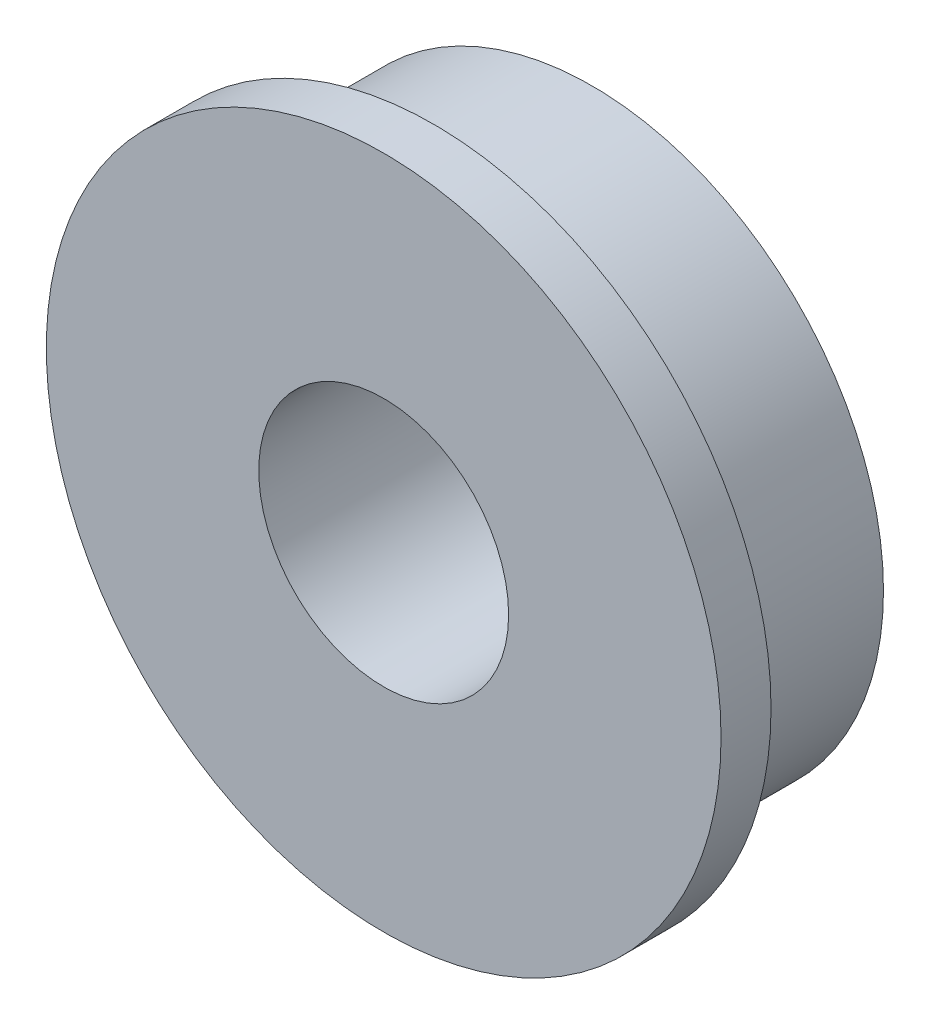
ISO-10303-21;
HEADER;
FILE_DESCRIPTION(('STEP AP214'),'2;1');
FILE_NAME('part.step','',(''),(''),'','','');
FILE_SCHEMA(('AUTOMOTIVE_DESIGN { 1 0 10303 214 1 1 1 1 }'));
ENDSEC;
DATA;
#1=APPLICATION_CONTEXT('core data for automotive mechanical design processes');
#2=APPLICATION_PROTOCOL_DEFINITION('international standard','automotive_design',2000,#1);
#3=PRODUCT_CONTEXT('',#1,'mechanical');
#4=PRODUCT('Part','Part','',(#3));
#5=PRODUCT_RELATED_PRODUCT_CATEGORY('part','',(#4));
#6=PRODUCT_DEFINITION_FORMATION('','',#4);
#7=PRODUCT_DEFINITION_CONTEXT('part definition',#1,'design');
#8=PRODUCT_DEFINITION('design','',#6,#7);
#9=PRODUCT_DEFINITION_SHAPE('','',#8);
#10=(LENGTH_UNIT() NAMED_UNIT(*) SI_UNIT(.MILLI.,.METRE.));
#11=(NAMED_UNIT(*) PLANE_ANGLE_UNIT() SI_UNIT($,.RADIAN.));
#12=(NAMED_UNIT(*) SI_UNIT($,.STERADIAN.) SOLID_ANGLE_UNIT());
#13=UNCERTAINTY_MEASURE_WITH_UNIT(LENGTH_MEASURE(1.E-05),#10,'distance_accuracy_value','');
#14=(GEOMETRIC_REPRESENTATION_CONTEXT(3) GLOBAL_UNCERTAINTY_ASSIGNED_CONTEXT((#13)) GLOBAL_UNIT_ASSIGNED_CONTEXT((#10,
#11,#12)) REPRESENTATION_CONTEXT('',''));
#15=CARTESIAN_POINT('',(0.,0.,0.));
#16=DIRECTION('',(0.,0.,1.));
#17=DIRECTION('',(1.,0.,0.));
#18=AXIS2_PLACEMENT_3D('',#15,#16,#17);
#19=CARTESIAN_POINT('',(0.,0.,2.5));
#20=DIRECTION('',(0.,0.,-1.));
#21=DIRECTION('',(-1.,0.,0.));
#22=AXIS2_PLACEMENT_3D('',#19,#20,#21);
#23=CYLINDRICAL_SURFACE('',#22,3.5);
#24=CARTESIAN_POINT('',(0.,0.,0.));
#25=DIRECTION('',(0.,0.,1.));
#26=DIRECTION('',(1.,0.,0.));
#27=AXIS2_PLACEMENT_3D('',#24,#25,#26);
#28=CIRCLE('',#27,3.5);
#29=CARTESIAN_POINT('',(3.5,0.,0.));
#30=VERTEX_POINT('',#29);
#31=EDGE_CURVE('E35',#30,#30,#28,.T.);
#32=ORIENTED_EDGE('',*,*,#31,.T.);
#33=EDGE_LOOP('',(#32));
#34=FACE_BOUND('',#33,.T.);
#35=CARTESIAN_POINT('',(0.,0.,1.9));
#36=DIRECTION('',(0.,0.,1.));
#37=DIRECTION('',(1.,0.,0.));
#38=AXIS2_PLACEMENT_3D('',#35,#36,#37);
#39=CIRCLE('',#38,3.5);
#40=CARTESIAN_POINT('',(3.5,0.,1.9));
#41=VERTEX_POINT('',#40);
#42=EDGE_CURVE('E10',#41,#41,#39,.T.);
#43=ORIENTED_EDGE('',*,*,#42,.F.);
#44=EDGE_LOOP('',(#43));
#45=FACE_BOUND('',#44,.T.);
#46=ADVANCED_FACE('F32',(#34,#45),#23,.T.);
#47=CARTESIAN_POINT('',(0.,0.,2.5));
#48=DIRECTION('',(0.,0.,1.));
#49=DIRECTION('',(1.,0.,0.));
#50=AXIS2_PLACEMENT_3D('',#47,#48,#49);
#51=PLANE('',#50);
#52=CARTESIAN_POINT('',(0.,0.,2.5));
#53=DIRECTION('',(0.,0.,1.));
#54=DIRECTION('',(1.,0.,0.));
#55=AXIS2_PLACEMENT_3D('',#52,#53,#54);
#56=CIRCLE('',#55,1.5);
#57=CARTESIAN_POINT('',(1.5,0.,2.5));
#58=VERTEX_POINT('',#57);
#59=EDGE_CURVE('E43',#58,#58,#56,.T.);
#60=ORIENTED_EDGE('',*,*,#59,.F.);
#61=EDGE_LOOP('',(#60));
#62=FACE_BOUND('',#61,.T.);
#63=CARTESIAN_POINT('',(0.,0.,2.5));
#64=DIRECTION('',(0.,0.,1.));
#65=DIRECTION('',(1.,0.,0.));
#66=AXIS2_PLACEMENT_3D('',#63,#64,#65);
#67=CIRCLE('',#66,4.05);
#68=CARTESIAN_POINT('',(4.05,0.,2.5));
#69=VERTEX_POINT('',#68);
#70=EDGE_CURVE('E46',#69,#69,#67,.T.);
#71=ORIENTED_EDGE('',*,*,#70,.T.);
#72=EDGE_LOOP('',(#71));
#73=FACE_BOUND('',#72,.T.);
#74=ADVANCED_FACE('F60',(#62,#73),#51,.T.);
#75=CARTESIAN_POINT('',(0.,0.,0.));
#76=DIRECTION('',(0.,0.,1.));
#77=DIRECTION('',(1.,0.,0.));
#78=AXIS2_PLACEMENT_3D('',#75,#76,#77);
#79=PLANE('',#78);
#80=ORIENTED_EDGE('',*,*,#31,.F.);
#81=EDGE_LOOP('',(#80));
#82=FACE_BOUND('',#81,.T.);
#83=CARTESIAN_POINT('',(0.,0.,0.));
#84=DIRECTION('',(0.,0.,1.));
#85=DIRECTION('',(1.,0.,0.));
#86=AXIS2_PLACEMENT_3D('',#83,#84,#85);
#87=CIRCLE('',#86,1.5);
#88=CARTESIAN_POINT('',(1.5,0.,0.));
#89=VERTEX_POINT('',#88);
#90=EDGE_CURVE('E49',#89,#89,#87,.T.);
#91=ORIENTED_EDGE('',*,*,#90,.T.);
#92=EDGE_LOOP('',(#91));
#93=FACE_BOUND('',#92,.T.);
#94=ADVANCED_FACE('F78',(#82,#93),#79,.F.);
#95=CARTESIAN_POINT('',(0.,0.,2.5));
#96=DIRECTION('',(0.,0.,-1.));
#97=DIRECTION('',(-1.,0.,0.));
#98=AXIS2_PLACEMENT_3D('',#95,#96,#97);
#99=CYLINDRICAL_SURFACE('',#98,1.5);
#100=ORIENTED_EDGE('',*,*,#59,.T.);
#101=EDGE_LOOP('',(#100));
#102=FACE_BOUND('',#101,.T.);
#103=ORIENTED_EDGE('',*,*,#90,.F.);
#104=EDGE_LOOP('',(#103));
#105=FACE_BOUND('',#104,.T.);
#106=ADVANCED_FACE('F69',(#102,#105),#99,.F.);
#107=CARTESIAN_POINT('',(0.,0.,1.9));
#108=DIRECTION('',(0.,0.,1.));
#109=DIRECTION('',(1.,0.,0.));
#110=AXIS2_PLACEMENT_3D('',#107,#108,#109);
#111=PLANE('',#110);
#112=CARTESIAN_POINT('',(0.,0.,1.9));
#113=DIRECTION('',(0.,0.,1.));
#114=DIRECTION('',(1.,0.,0.));
#115=AXIS2_PLACEMENT_3D('',#112,#113,#114);
#116=CIRCLE('',#115,4.05);
#117=CARTESIAN_POINT('',(4.05,0.,1.9));
#118=VERTEX_POINT('',#117);
#119=EDGE_CURVE('E51',#118,#118,#116,.T.);
#120=ORIENTED_EDGE('',*,*,#119,.F.);
#121=EDGE_LOOP('',(#120));
#122=FACE_BOUND('',#121,.T.);
#123=ORIENTED_EDGE('',*,*,#42,.T.);
#124=EDGE_LOOP('',(#123));
#125=FACE_BOUND('',#124,.T.);
#126=ADVANCED_FACE('F64',(#122,#125),#111,.F.);
#127=CARTESIAN_POINT('',(0.,0.,1.9));
#128=DIRECTION('',(0.,0.,1.));
#129=DIRECTION('',(1.,0.,0.));
#130=AXIS2_PLACEMENT_3D('',#127,#128,#129);
#131=CYLINDRICAL_SURFACE('',#130,4.05);
#132=ORIENTED_EDGE('',*,*,#119,.T.);
#133=EDGE_LOOP('',(#132));
#134=FACE_BOUND('',#133,.T.);
#135=ORIENTED_EDGE('',*,*,#70,.F.);
#136=EDGE_LOOP('',(#135));
#137=FACE_BOUND('',#136,.T.);
#138=ADVANCED_FACE('F62',(#134,#137),#131,.T.);
#139=CLOSED_SHELL('',(#46,#74,#94,#106,#126,#138));
#140=MANIFOLD_SOLID_BREP('B2',#139);
#141=ADVANCED_BREP_SHAPE_REPRESENTATION('',(#18,#140),#14);
#142=SHAPE_DEFINITION_REPRESENTATION(#9,#141);
ENDSEC;
END-ISO-10303-21;
